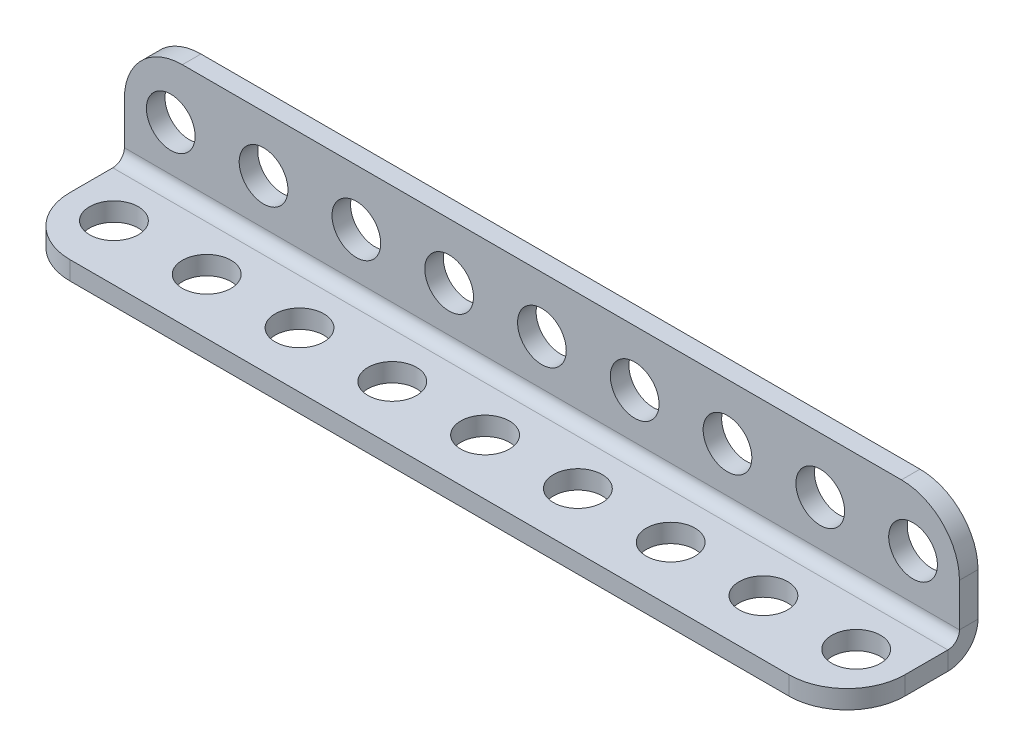
ISO-10303-21;
HEADER;
FILE_DESCRIPTION(('STEP AP214'),'2;1');
FILE_NAME('part.step','',(''),(''),'','','');
FILE_SCHEMA(('AUTOMOTIVE_DESIGN { 1 0 10303 214 1 1 1 1 }'));
ENDSEC;
DATA;
#1=APPLICATION_CONTEXT('core data for automotive mechanical design processes');
#2=APPLICATION_PROTOCOL_DEFINITION('international standard','automotive_design',2000,#1);
#3=PRODUCT_CONTEXT('',#1,'mechanical');
#4=PRODUCT('Part','Part','',(#3));
#5=PRODUCT_RELATED_PRODUCT_CATEGORY('part','',(#4));
#6=PRODUCT_DEFINITION_FORMATION('','',#4);
#7=PRODUCT_DEFINITION_CONTEXT('part definition',#1,'design');
#8=PRODUCT_DEFINITION('design','',#6,#7);
#9=PRODUCT_DEFINITION_SHAPE('','',#8);
#10=(LENGTH_UNIT() NAMED_UNIT(*) SI_UNIT(.MILLI.,.METRE.));
#11=(NAMED_UNIT(*) PLANE_ANGLE_UNIT() SI_UNIT($,.RADIAN.));
#12=(NAMED_UNIT(*) SI_UNIT($,.STERADIAN.) SOLID_ANGLE_UNIT());
#13=UNCERTAINTY_MEASURE_WITH_UNIT(LENGTH_MEASURE(1.E-05),#10,'distance_accuracy_value','');
#14=(GEOMETRIC_REPRESENTATION_CONTEXT(3) GLOBAL_UNCERTAINTY_ASSIGNED_CONTEXT((#13)) GLOBAL_UNIT_ASSIGNED_CONTEXT((#10,
#11,#12)) REPRESENTATION_CONTEXT('',''));
#15=CARTESIAN_POINT('',(0.,0.,0.));
#16=DIRECTION('',(0.,0.,1.));
#17=DIRECTION('',(1.,0.,0.));
#18=AXIS2_PLACEMENT_3D('',#15,#16,#17);
#19=CARTESIAN_POINT('',(72.,0.,2.6));
#20=DIRECTION('',(1.,0.,0.));
#21=DIRECTION('',(0.,0.,-1.));
#22=AXIS2_PLACEMENT_3D('',#19,#20,#21);
#23=PLANE('',#22);
#24=DIRECTION('',(0.,1.,0.));
#25=VECTOR('',#24,1.);
#26=CARTESIAN_POINT('',(72.,0.,2.6));
#27=LINE('',#26,#25);
#28=CARTESIAN_POINT('',(72.,0.,2.6));
#29=VERTEX_POINT('',#28);
#30=CARTESIAN_POINT('',(72.,1.6,2.6));
#31=VERTEX_POINT('',#30);
#32=EDGE_CURVE('E127',#29,#31,#27,.T.);
#33=ORIENTED_EDGE('',*,*,#32,.F.);
#34=CARTESIAN_POINT('',(72.,2.6,2.6));
#35=DIRECTION('',(1.,0.,0.));
#36=DIRECTION('',(0.,0.,-1.));
#37=AXIS2_PLACEMENT_3D('',#34,#35,#36);
#38=CIRCLE('',#37,2.6);
#39=CARTESIAN_POINT('',(72.,2.6,0.));
#40=VERTEX_POINT('',#39);
#41=EDGE_CURVE('E131',#40,#29,#38,.F.);
#42=ORIENTED_EDGE('',*,*,#41,.F.);
#43=DIRECTION('',(0.,0.,-1.));
#44=VECTOR('',#43,1.);
#45=CARTESIAN_POINT('',(72.,2.6,1.6));
#46=LINE('',#45,#44);
#47=CARTESIAN_POINT('',(72.,2.6,1.6));
#48=VERTEX_POINT('',#47);
#49=EDGE_CURVE('E139',#48,#40,#46,.T.);
#50=ORIENTED_EDGE('',*,*,#49,.F.);
#51=CARTESIAN_POINT('',(72.,2.6,2.6));
#52=DIRECTION('',(1.,0.,0.));
#53=DIRECTION('',(0.,0.,-1.));
#54=AXIS2_PLACEMENT_3D('',#51,#52,#53);
#55=CIRCLE('',#54,1.);
#56=EDGE_CURVE('E133',#48,#31,#55,.F.);
#57=ORIENTED_EDGE('',*,*,#56,.T.);
#58=EDGE_LOOP('',(#33,#42,#50,#57));
#59=FACE_BOUND('',#58,.T.);
#60=ADVANCED_FACE('F36',(#59),#23,.T.);
#61=CARTESIAN_POINT('',(72.,2.6,1.6));
#62=DIRECTION('',(1.,0.,0.));
#63=DIRECTION('',(0.,0.,-1.));
#64=AXIS2_PLACEMENT_3D('',#61,#62,#63);
#65=PLANE('',#64);
#66=DIRECTION('',(0.,0.,1.));
#67=VECTOR('',#66,1.);
#68=CARTESIAN_POINT('',(72.,1.6,0.));
#69=LINE('',#68,#67);
#70=CARTESIAN_POINT('',(72.,1.6,6.3));
#71=VERTEX_POINT('',#70);
#72=EDGE_CURVE('E161',#31,#71,#69,.T.);
#73=ORIENTED_EDGE('',*,*,#72,.T.);
#74=DIRECTION('',(0.,1.,0.));
#75=VECTOR('',#74,1.);
#76=CARTESIAN_POINT('',(72.,2.6,6.3));
#77=LINE('',#76,#75);
#78=CARTESIAN_POINT('',(72.,0.,6.3));
#79=VERTEX_POINT('',#78);
#80=EDGE_CURVE('E160',#71,#79,#77,.F.);
#81=ORIENTED_EDGE('',*,*,#80,.T.);
#82=DIRECTION('',(0.,0.,1.));
#83=VECTOR('',#82,1.);
#84=CARTESIAN_POINT('',(72.,0.,0.));
#85=LINE('',#84,#83);
#86=EDGE_CURVE('E148',#29,#79,#85,.T.);
#87=ORIENTED_EDGE('',*,*,#86,.F.);
#88=ORIENTED_EDGE('',*,*,#32,.T.);
#89=EDGE_LOOP('',(#73,#81,#87,#88));
#90=FACE_BOUND('',#89,.T.);
#91=ADVANCED_FACE('F158',(#90),#65,.T.);
#92=CARTESIAN_POINT('',(0.,2.6,0.));
#93=DIRECTION('',(-1.,0.,0.));
#94=DIRECTION('',(0.,0.,1.));
#95=AXIS2_PLACEMENT_3D('',#92,#93,#94);
#96=PLANE('',#95);
#97=DIRECTION('',(0.,0.,1.));
#98=VECTOR('',#97,1.);
#99=CARTESIAN_POINT('',(0.,2.6,0.));
#100=LINE('',#99,#98);
#101=CARTESIAN_POINT('',(0.,2.6,0.));
#102=VERTEX_POINT('',#101);
#103=CARTESIAN_POINT('',(0.,2.6,1.6));
#104=VERTEX_POINT('',#103);
#105=EDGE_CURVE('E206',#102,#104,#100,.T.);
#106=ORIENTED_EDGE('',*,*,#105,.F.);
#107=CARTESIAN_POINT('',(0.,2.6,2.6));
#108=DIRECTION('',(1.,0.,0.));
#109=DIRECTION('',(0.,0.,-1.));
#110=AXIS2_PLACEMENT_3D('',#107,#108,#109);
#111=CIRCLE('',#110,2.6);
#112=CARTESIAN_POINT('',(0.,0.,2.6));
#113=VERTEX_POINT('',#112);
#114=EDGE_CURVE('E180',#102,#113,#111,.F.);
#115=ORIENTED_EDGE('',*,*,#114,.T.);
#116=DIRECTION('',(0.,-1.,0.));
#117=VECTOR('',#116,1.);
#118=CARTESIAN_POINT('',(0.,1.6,2.6));
#119=LINE('',#118,#117);
#120=CARTESIAN_POINT('',(0.,1.6,2.6));
#121=VERTEX_POINT('',#120);
#122=EDGE_CURVE('E204',#121,#113,#119,.T.);
#123=ORIENTED_EDGE('',*,*,#122,.F.);
#124=CARTESIAN_POINT('',(0.,2.6,2.6));
#125=DIRECTION('',(1.,0.,0.));
#126=DIRECTION('',(0.,0.,-1.));
#127=AXIS2_PLACEMENT_3D('',#124,#125,#126);
#128=CIRCLE('',#127,1.);
#129=EDGE_CURVE('E186',#104,#121,#128,.F.);
#130=ORIENTED_EDGE('',*,*,#129,.F.);
#131=EDGE_LOOP('',(#106,#115,#123,#130));
#132=FACE_BOUND('',#131,.T.);
#133=ADVANCED_FACE('F419',(#132),#96,.T.);
#134=CARTESIAN_POINT('',(0.,1.6,2.6));
#135=DIRECTION('',(-1.,0.,0.));
#136=DIRECTION('',(0.,0.,1.));
#137=AXIS2_PLACEMENT_3D('',#134,#135,#136);
#138=PLANE('',#137);
#139=DIRECTION('',(0.,-1.,0.));
#140=VECTOR('',#139,1.);
#141=CARTESIAN_POINT('',(0.,11.3,1.6));
#142=LINE('',#141,#140);
#143=CARTESIAN_POINT('',(0.,6.3,1.6));
#144=VERTEX_POINT('',#143);
#145=EDGE_CURVE('E184',#144,#104,#142,.T.);
#146=ORIENTED_EDGE('',*,*,#145,.F.);
#147=DIRECTION('',(0.,0.,-1.));
#148=VECTOR('',#147,1.);
#149=CARTESIAN_POINT('',(0.,6.3,2.6));
#150=LINE('',#149,#148);
#151=CARTESIAN_POINT('',(0.,6.3,0.));
#152=VERTEX_POINT('',#151);
#153=EDGE_CURVE('E11',#144,#152,#150,.T.);
#154=ORIENTED_EDGE('',*,*,#153,.T.);
#155=DIRECTION('',(0.,-1.,0.));
#156=VECTOR('',#155,1.);
#157=CARTESIAN_POINT('',(0.,11.3,0.));
#158=LINE('',#157,#156);
#159=EDGE_CURVE('E182',#152,#102,#158,.T.);
#160=ORIENTED_EDGE('',*,*,#159,.T.);
#161=ORIENTED_EDGE('',*,*,#105,.T.);
#162=EDGE_LOOP('',(#146,#154,#160,#161));
#163=FACE_BOUND('',#162,.T.);
#164=ADVANCED_FACE('F380',(#163),#138,.T.);
#165=CARTESIAN_POINT('',(72.,1.6,0.));
#166=DIRECTION('',(0.,-1.,0.));
#167=DIRECTION('',(0.,0.,-1.));
#168=AXIS2_PLACEMENT_3D('',#165,#166,#167);
#169=PLANE('',#168);
#170=CARTESIAN_POINT('',(68.,1.6,6.5));
#171=DIRECTION('',(0.,1.,0.));
#172=DIRECTION('',(0.,0.,1.));
#173=AXIS2_PLACEMENT_3D('',#170,#171,#172);
#174=CIRCLE('',#173,2.1);
#175=CARTESIAN_POINT('',(68.,1.6,8.6));
#176=VERTEX_POINT('',#175);
#177=EDGE_CURVE('E362',#176,#176,#174,.T.);
#178=ORIENTED_EDGE('',*,*,#177,.F.);
#179=EDGE_LOOP('',(#178));
#180=FACE_BOUND('',#179,.T.);
#181=CARTESIAN_POINT('',(60.,1.6,6.5));
#182=DIRECTION('',(0.,1.,0.));
#183=DIRECTION('',(0.,0.,1.));
#184=AXIS2_PLACEMENT_3D('',#181,#182,#183);
#185=CIRCLE('',#184,2.1);
#186=CARTESIAN_POINT('',(60.,1.6,8.6));
#187=VERTEX_POINT('',#186);
#188=EDGE_CURVE('E356',#187,#187,#185,.T.);
#189=ORIENTED_EDGE('',*,*,#188,.F.);
#190=EDGE_LOOP('',(#189));
#191=FACE_BOUND('',#190,.T.);
#192=CARTESIAN_POINT('',(52.,1.6,6.5));
#193=DIRECTION('',(0.,1.,0.));
#194=DIRECTION('',(0.,0.,1.));
#195=AXIS2_PLACEMENT_3D('',#192,#193,#194);
#196=CIRCLE('',#195,2.1);
#197=CARTESIAN_POINT('',(52.,1.6,8.6));
#198=VERTEX_POINT('',#197);
#199=EDGE_CURVE('E350',#198,#198,#196,.T.);
#200=ORIENTED_EDGE('',*,*,#199,.F.);
#201=EDGE_LOOP('',(#200));
#202=FACE_BOUND('',#201,.T.);
#203=CARTESIAN_POINT('',(44.,1.6,6.5));
#204=DIRECTION('',(0.,1.,0.));
#205=DIRECTION('',(0.,0.,1.));
#206=AXIS2_PLACEMENT_3D('',#203,#204,#205);
#207=CIRCLE('',#206,2.1);
#208=CARTESIAN_POINT('',(44.,1.6,8.6));
#209=VERTEX_POINT('',#208);
#210=EDGE_CURVE('E344',#209,#209,#207,.T.);
#211=ORIENTED_EDGE('',*,*,#210,.F.);
#212=EDGE_LOOP('',(#211));
#213=FACE_BOUND('',#212,.T.);
#214=CARTESIAN_POINT('',(36.,1.6,6.5));
#215=DIRECTION('',(0.,1.,0.));
#216=DIRECTION('',(0.,0.,1.));
#217=AXIS2_PLACEMENT_3D('',#214,#215,#216);
#218=CIRCLE('',#217,2.1);
#219=CARTESIAN_POINT('',(36.,1.6,8.6));
#220=VERTEX_POINT('',#219);
#221=EDGE_CURVE('E338',#220,#220,#218,.T.);
#222=ORIENTED_EDGE('',*,*,#221,.F.);
#223=EDGE_LOOP('',(#222));
#224=FACE_BOUND('',#223,.T.);
#225=CARTESIAN_POINT('',(28.,1.6,6.5));
#226=DIRECTION('',(0.,1.,0.));
#227=DIRECTION('',(0.,0.,1.));
#228=AXIS2_PLACEMENT_3D('',#225,#226,#227);
#229=CIRCLE('',#228,2.1);
#230=CARTESIAN_POINT('',(28.,1.6,8.6));
#231=VERTEX_POINT('',#230);
#232=EDGE_CURVE('E332',#231,#231,#229,.T.);
#233=ORIENTED_EDGE('',*,*,#232,.F.);
#234=EDGE_LOOP('',(#233));
#235=FACE_BOUND('',#234,.T.);
#236=CARTESIAN_POINT('',(20.,1.6,6.5));
#237=DIRECTION('',(0.,1.,0.));
#238=DIRECTION('',(0.,0.,1.));
#239=AXIS2_PLACEMENT_3D('',#236,#237,#238);
#240=CIRCLE('',#239,2.1);
#241=CARTESIAN_POINT('',(20.,1.6,8.6));
#242=VERTEX_POINT('',#241);
#243=EDGE_CURVE('E326',#242,#242,#240,.T.);
#244=ORIENTED_EDGE('',*,*,#243,.F.);
#245=EDGE_LOOP('',(#244));
#246=FACE_BOUND('',#245,.T.);
#247=CARTESIAN_POINT('',(12.,1.6,6.5));
#248=DIRECTION('',(0.,1.,0.));
#249=DIRECTION('',(0.,0.,1.));
#250=AXIS2_PLACEMENT_3D('',#247,#248,#249);
#251=CIRCLE('',#250,2.1);
#252=CARTESIAN_POINT('',(12.,1.6,8.6));
#253=VERTEX_POINT('',#252);
#254=EDGE_CURVE('E320',#253,#253,#251,.T.);
#255=ORIENTED_EDGE('',*,*,#254,.F.);
#256=EDGE_LOOP('',(#255));
#257=FACE_BOUND('',#256,.T.);
#258=CARTESIAN_POINT('',(4.,1.6,6.5));
#259=DIRECTION('',(0.,1.,0.));
#260=DIRECTION('',(0.,0.,1.));
#261=AXIS2_PLACEMENT_3D('',#258,#259,#260);
#262=CIRCLE('',#261,2.1);
#263=CARTESIAN_POINT('',(4.,1.6,8.6));
#264=VERTEX_POINT('',#263);
#265=EDGE_CURVE('E266',#264,#264,#262,.T.);
#266=ORIENTED_EDGE('',*,*,#265,.F.);
#267=EDGE_LOOP('',(#266));
#268=FACE_BOUND('',#267,.T.);
#269=DIRECTION('',(0.,0.,1.));
#270=VECTOR('',#269,1.);
#271=CARTESIAN_POINT('',(0.,1.6,0.));
#272=LINE('',#271,#270);
#273=CARTESIAN_POINT('',(0.,1.6,6.3));
#274=VERTEX_POINT('',#273);
#275=EDGE_CURVE('E175',#121,#274,#272,.T.);
#276=ORIENTED_EDGE('',*,*,#275,.T.);
#277=CARTESIAN_POINT('',(5.,1.6,6.3));
#278=DIRECTION('',(0.,-1.,0.));
#279=DIRECTION('',(0.,0.,-1.));
#280=AXIS2_PLACEMENT_3D('',#277,#278,#279);
#281=CIRCLE('',#280,5.);
#282=CARTESIAN_POINT('',(5.,1.6,11.3));
#283=VERTEX_POINT('',#282);
#284=EDGE_CURVE('E215',#274,#283,#281,.F.);
#285=ORIENTED_EDGE('',*,*,#284,.T.);
#286=DIRECTION('',(-1.,0.,0.));
#287=VECTOR('',#286,1.);
#288=CARTESIAN_POINT('',(72.,1.6,11.3));
#289=LINE('',#288,#287);
#290=CARTESIAN_POINT('',(67.,1.6,11.3));
#291=VERTEX_POINT('',#290);
#292=EDGE_CURVE('E201',#291,#283,#289,.T.);
#293=ORIENTED_EDGE('',*,*,#292,.F.);
#294=CARTESIAN_POINT('',(67.,1.6,6.3));
#295=DIRECTION('',(0.,-1.,0.));
#296=DIRECTION('',(0.,0.,-1.));
#297=AXIS2_PLACEMENT_3D('',#294,#295,#296);
#298=CIRCLE('',#297,5.);
#299=EDGE_CURVE('E213',#291,#71,#298,.F.);
#300=ORIENTED_EDGE('',*,*,#299,.T.);
#301=ORIENTED_EDGE('',*,*,#72,.F.);
#302=DIRECTION('',(-1.,0.,0.));
#303=VECTOR('',#302,1.);
#304=CARTESIAN_POINT('',(72.,1.6,2.6));
#305=LINE('',#304,#303);
#306=EDGE_CURVE('E174',#31,#121,#305,.T.);
#307=ORIENTED_EDGE('',*,*,#306,.T.);
#308=EDGE_LOOP('',(#276,#285,#293,#300,#301,#307));
#309=FACE_BOUND('',#308,.T.);
#310=ADVANCED_FACE('F257',(#180,#191,#202,#213,#224,#235,#246,#257,#268,#309),#169,.F.);
#311=CARTESIAN_POINT('',(72.,0.,11.3));
#312=DIRECTION('',(0.,0.,1.));
#313=DIRECTION('',(1.,0.,0.));
#314=AXIS2_PLACEMENT_3D('',#311,#312,#313);
#315=PLANE('',#314);
#316=ORIENTED_EDGE('',*,*,#292,.T.);
#317=DIRECTION('',(0.,1.,0.));
#318=VECTOR('',#317,1.);
#319=CARTESIAN_POINT('',(5.,0.,11.3));
#320=LINE('',#319,#318);
#321=CARTESIAN_POINT('',(5.,0.,11.3));
#322=VERTEX_POINT('',#321);
#323=EDGE_CURVE('E220',#283,#322,#320,.F.);
#324=ORIENTED_EDGE('',*,*,#323,.T.);
#325=DIRECTION('',(-1.,0.,0.));
#326=VECTOR('',#325,1.);
#327=CARTESIAN_POINT('',(72.,0.,11.3));
#328=LINE('',#327,#326);
#329=CARTESIAN_POINT('',(67.,0.,11.3));
#330=VERTEX_POINT('',#329);
#331=EDGE_CURVE('E155',#330,#322,#328,.T.);
#332=ORIENTED_EDGE('',*,*,#331,.F.);
#333=DIRECTION('',(0.,1.,0.));
#334=VECTOR('',#333,1.);
#335=CARTESIAN_POINT('',(67.,0.,11.3));
#336=LINE('',#335,#334);
#337=EDGE_CURVE('E217',#330,#291,#336,.T.);
#338=ORIENTED_EDGE('',*,*,#337,.T.);
#339=EDGE_LOOP('',(#316,#324,#332,#338));
#340=FACE_BOUND('',#339,.T.);
#341=ADVANCED_FACE('F379',(#340),#315,.T.);
#342=CARTESIAN_POINT('',(72.,0.,0.));
#343=DIRECTION('',(0.,-1.,0.));
#344=DIRECTION('',(0.,0.,-1.));
#345=AXIS2_PLACEMENT_3D('',#342,#343,#344);
#346=PLANE('',#345);
#347=CARTESIAN_POINT('',(68.,0.,6.5));
#348=DIRECTION('',(0.,1.,0.));
#349=DIRECTION('',(0.,0.,1.));
#350=AXIS2_PLACEMENT_3D('',#347,#348,#349);
#351=CIRCLE('',#350,2.1);
#352=CARTESIAN_POINT('',(68.,0.,8.6));
#353=VERTEX_POINT('',#352);
#354=EDGE_CURVE('E359',#353,#353,#351,.T.);
#355=ORIENTED_EDGE('',*,*,#354,.T.);
#356=EDGE_LOOP('',(#355));
#357=FACE_BOUND('',#356,.T.);
#358=CARTESIAN_POINT('',(60.,0.,6.5));
#359=DIRECTION('',(0.,1.,0.));
#360=DIRECTION('',(0.,0.,1.));
#361=AXIS2_PLACEMENT_3D('',#358,#359,#360);
#362=CIRCLE('',#361,2.1);
#363=CARTESIAN_POINT('',(60.,0.,8.6));
#364=VERTEX_POINT('',#363);
#365=EDGE_CURVE('E353',#364,#364,#362,.T.);
#366=ORIENTED_EDGE('',*,*,#365,.T.);
#367=EDGE_LOOP('',(#366));
#368=FACE_BOUND('',#367,.T.);
#369=CARTESIAN_POINT('',(52.,0.,6.5));
#370=DIRECTION('',(0.,1.,0.));
#371=DIRECTION('',(0.,0.,1.));
#372=AXIS2_PLACEMENT_3D('',#369,#370,#371);
#373=CIRCLE('',#372,2.1);
#374=CARTESIAN_POINT('',(52.,0.,8.6));
#375=VERTEX_POINT('',#374);
#376=EDGE_CURVE('E347',#375,#375,#373,.T.);
#377=ORIENTED_EDGE('',*,*,#376,.T.);
#378=EDGE_LOOP('',(#377));
#379=FACE_BOUND('',#378,.T.);
#380=CARTESIAN_POINT('',(44.,0.,6.5));
#381=DIRECTION('',(0.,1.,0.));
#382=DIRECTION('',(0.,0.,1.));
#383=AXIS2_PLACEMENT_3D('',#380,#381,#382);
#384=CIRCLE('',#383,2.1);
#385=CARTESIAN_POINT('',(44.,0.,8.6));
#386=VERTEX_POINT('',#385);
#387=EDGE_CURVE('E341',#386,#386,#384,.T.);
#388=ORIENTED_EDGE('',*,*,#387,.T.);
#389=EDGE_LOOP('',(#388));
#390=FACE_BOUND('',#389,.T.);
#391=CARTESIAN_POINT('',(36.,0.,6.5));
#392=DIRECTION('',(0.,1.,0.));
#393=DIRECTION('',(0.,0.,1.));
#394=AXIS2_PLACEMENT_3D('',#391,#392,#393);
#395=CIRCLE('',#394,2.1);
#396=CARTESIAN_POINT('',(36.,0.,8.6));
#397=VERTEX_POINT('',#396);
#398=EDGE_CURVE('E335',#397,#397,#395,.T.);
#399=ORIENTED_EDGE('',*,*,#398,.T.);
#400=EDGE_LOOP('',(#399));
#401=FACE_BOUND('',#400,.T.);
#402=CARTESIAN_POINT('',(28.,0.,6.5));
#403=DIRECTION('',(0.,1.,0.));
#404=DIRECTION('',(0.,0.,1.));
#405=AXIS2_PLACEMENT_3D('',#402,#403,#404);
#406=CIRCLE('',#405,2.1);
#407=CARTESIAN_POINT('',(28.,0.,8.6));
#408=VERTEX_POINT('',#407);
#409=EDGE_CURVE('E329',#408,#408,#406,.T.);
#410=ORIENTED_EDGE('',*,*,#409,.T.);
#411=EDGE_LOOP('',(#410));
#412=FACE_BOUND('',#411,.T.);
#413=CARTESIAN_POINT('',(20.,0.,6.5));
#414=DIRECTION('',(0.,1.,0.));
#415=DIRECTION('',(0.,0.,1.));
#416=AXIS2_PLACEMENT_3D('',#413,#414,#415);
#417=CIRCLE('',#416,2.1);
#418=CARTESIAN_POINT('',(20.,0.,8.6));
#419=VERTEX_POINT('',#418);
#420=EDGE_CURVE('E323',#419,#419,#417,.T.);
#421=ORIENTED_EDGE('',*,*,#420,.T.);
#422=EDGE_LOOP('',(#421));
#423=FACE_BOUND('',#422,.T.);
#424=CARTESIAN_POINT('',(12.,0.,6.5));
#425=DIRECTION('',(0.,1.,0.));
#426=DIRECTION('',(0.,0.,1.));
#427=AXIS2_PLACEMENT_3D('',#424,#425,#426);
#428=CIRCLE('',#427,2.1);
#429=CARTESIAN_POINT('',(12.,0.,8.6));
#430=VERTEX_POINT('',#429);
#431=EDGE_CURVE('E317',#430,#430,#428,.T.);
#432=ORIENTED_EDGE('',*,*,#431,.T.);
#433=EDGE_LOOP('',(#432));
#434=FACE_BOUND('',#433,.T.);
#435=CARTESIAN_POINT('',(4.,0.,6.5));
#436=DIRECTION('',(0.,1.,0.));
#437=DIRECTION('',(0.,0.,1.));
#438=AXIS2_PLACEMENT_3D('',#435,#436,#437);
#439=CIRCLE('',#438,2.1);
#440=CARTESIAN_POINT('',(4.,0.,8.6));
#441=VERTEX_POINT('',#440);
#442=EDGE_CURVE('E263',#441,#441,#439,.T.);
#443=ORIENTED_EDGE('',*,*,#442,.T.);
#444=EDGE_LOOP('',(#443));
#445=FACE_BOUND('',#444,.T.);
#446=ORIENTED_EDGE('',*,*,#331,.T.);
#447=CARTESIAN_POINT('',(5.,0.,6.3));
#448=DIRECTION('',(0.,-1.,0.));
#449=DIRECTION('',(0.,0.,-1.));
#450=AXIS2_PLACEMENT_3D('',#447,#448,#449);
#451=CIRCLE('',#450,5.);
#452=CARTESIAN_POINT('',(0.,0.,6.3));
#453=VERTEX_POINT('',#452);
#454=EDGE_CURVE('E224',#322,#453,#451,.T.);
#455=ORIENTED_EDGE('',*,*,#454,.T.);
#456=DIRECTION('',(0.,0.,1.));
#457=VECTOR('',#456,1.);
#458=CARTESIAN_POINT('',(0.,0.,0.));
#459=LINE('',#458,#457);
#460=EDGE_CURVE('E151',#113,#453,#459,.T.);
#461=ORIENTED_EDGE('',*,*,#460,.F.);
#462=DIRECTION('',(-1.,0.,0.));
#463=VECTOR('',#462,1.);
#464=CARTESIAN_POINT('',(72.,0.,2.6));
#465=LINE('',#464,#463);
#466=EDGE_CURVE('E145',#29,#113,#465,.T.);
#467=ORIENTED_EDGE('',*,*,#466,.F.);
#468=ORIENTED_EDGE('',*,*,#86,.T.);
#469=CARTESIAN_POINT('',(67.,0.,6.3));
#470=DIRECTION('',(0.,-1.,0.));
#471=DIRECTION('',(0.,0.,-1.));
#472=AXIS2_PLACEMENT_3D('',#469,#470,#471);
#473=CIRCLE('',#472,5.);
#474=EDGE_CURVE('E222',#79,#330,#473,.T.);
#475=ORIENTED_EDGE('',*,*,#474,.T.);
#476=EDGE_LOOP('',(#446,#455,#461,#467,#468,#475));
#477=FACE_BOUND('',#476,.T.);
#478=ADVANCED_FACE('F147',(#357,#368,#379,#390,#401,#412,#423,#434,#445,#477),#346,.T.);
#479=CARTESIAN_POINT('',(72.,2.6,2.6));
#480=DIRECTION('',(-1.,0.,0.));
#481=DIRECTION('',(0.,0.,1.));
#482=AXIS2_PLACEMENT_3D('',#479,#480,#481);
#483=CYLINDRICAL_SURFACE('',#482,2.6);
#484=ORIENTED_EDGE('',*,*,#114,.F.);
#485=DIRECTION('',(-1.,0.,0.));
#486=VECTOR('',#485,1.);
#487=CARTESIAN_POINT('',(72.,2.6,0.));
#488=LINE('',#487,#486);
#489=EDGE_CURVE('E156',#40,#102,#488,.T.);
#490=ORIENTED_EDGE('',*,*,#489,.F.);
#491=ORIENTED_EDGE('',*,*,#41,.T.);
#492=ORIENTED_EDGE('',*,*,#466,.T.);
#493=EDGE_LOOP('',(#484,#490,#491,#492));
#494=FACE_BOUND('',#493,.T.);
#495=ADVANCED_FACE('F164',(#494),#483,.T.);
#496=CARTESIAN_POINT('',(72.,11.3,0.));
#497=DIRECTION('',(0.,0.,-1.));
#498=DIRECTION('',(0.,1.,0.));
#499=AXIS2_PLACEMENT_3D('',#496,#497,#498);
#500=PLANE('',#499);
#501=CARTESIAN_POINT('',(68.,6.5,0.));
#502=DIRECTION('',(0.,0.,1.));
#503=DIRECTION('',(1.,0.,0.));
#504=AXIS2_PLACEMENT_3D('',#501,#502,#503);
#505=CIRCLE('',#504,2.1);
#506=CARTESIAN_POINT('',(70.1,6.5,0.));
#507=VERTEX_POINT('',#506);
#508=EDGE_CURVE('E311',#507,#507,#505,.T.);
#509=ORIENTED_EDGE('',*,*,#508,.T.);
#510=EDGE_LOOP('',(#509));
#511=FACE_BOUND('',#510,.T.);
#512=CARTESIAN_POINT('',(60.,6.5,0.));
#513=DIRECTION('',(0.,0.,1.));
#514=DIRECTION('',(1.,0.,0.));
#515=AXIS2_PLACEMENT_3D('',#512,#513,#514);
#516=CIRCLE('',#515,2.1);
#517=CARTESIAN_POINT('',(62.1,6.5,0.));
#518=VERTEX_POINT('',#517);
#519=EDGE_CURVE('E305',#518,#518,#516,.T.);
#520=ORIENTED_EDGE('',*,*,#519,.T.);
#521=EDGE_LOOP('',(#520));
#522=FACE_BOUND('',#521,.T.);
#523=CARTESIAN_POINT('',(52.,6.5,0.));
#524=DIRECTION('',(0.,0.,1.));
#525=DIRECTION('',(1.,0.,0.));
#526=AXIS2_PLACEMENT_3D('',#523,#524,#525);
#527=CIRCLE('',#526,2.1);
#528=CARTESIAN_POINT('',(54.1,6.5,0.));
#529=VERTEX_POINT('',#528);
#530=EDGE_CURVE('E299',#529,#529,#527,.T.);
#531=ORIENTED_EDGE('',*,*,#530,.T.);
#532=EDGE_LOOP('',(#531));
#533=FACE_BOUND('',#532,.T.);
#534=CARTESIAN_POINT('',(44.,6.5,0.));
#535=DIRECTION('',(0.,0.,1.));
#536=DIRECTION('',(1.,0.,0.));
#537=AXIS2_PLACEMENT_3D('',#534,#535,#536);
#538=CIRCLE('',#537,2.1);
#539=CARTESIAN_POINT('',(46.1,6.5,0.));
#540=VERTEX_POINT('',#539);
#541=EDGE_CURVE('E293',#540,#540,#538,.T.);
#542=ORIENTED_EDGE('',*,*,#541,.T.);
#543=EDGE_LOOP('',(#542));
#544=FACE_BOUND('',#543,.T.);
#545=CARTESIAN_POINT('',(36.,6.5,0.));
#546=DIRECTION('',(0.,0.,1.));
#547=DIRECTION('',(1.,0.,0.));
#548=AXIS2_PLACEMENT_3D('',#545,#546,#547);
#549=CIRCLE('',#548,2.1);
#550=CARTESIAN_POINT('',(38.1,6.5,0.));
#551=VERTEX_POINT('',#550);
#552=EDGE_CURVE('E287',#551,#551,#549,.T.);
#553=ORIENTED_EDGE('',*,*,#552,.T.);
#554=EDGE_LOOP('',(#553));
#555=FACE_BOUND('',#554,.T.);
#556=CARTESIAN_POINT('',(28.,6.5,0.));
#557=DIRECTION('',(0.,0.,1.));
#558=DIRECTION('',(1.,0.,0.));
#559=AXIS2_PLACEMENT_3D('',#556,#557,#558);
#560=CIRCLE('',#559,2.1);
#561=CARTESIAN_POINT('',(30.1,6.5,0.));
#562=VERTEX_POINT('',#561);
#563=EDGE_CURVE('E281',#562,#562,#560,.T.);
#564=ORIENTED_EDGE('',*,*,#563,.T.);
#565=EDGE_LOOP('',(#564));
#566=FACE_BOUND('',#565,.T.);
#567=CARTESIAN_POINT('',(20.,6.5,0.));
#568=DIRECTION('',(0.,0.,1.));
#569=DIRECTION('',(1.,0.,0.));
#570=AXIS2_PLACEMENT_3D('',#567,#568,#569);
#571=CIRCLE('',#570,2.1);
#572=CARTESIAN_POINT('',(22.1,6.5,0.));
#573=VERTEX_POINT('',#572);
#574=EDGE_CURVE('E275',#573,#573,#571,.T.);
#575=ORIENTED_EDGE('',*,*,#574,.T.);
#576=EDGE_LOOP('',(#575));
#577=FACE_BOUND('',#576,.T.);
#578=CARTESIAN_POINT('',(12.,6.5,0.));
#579=DIRECTION('',(0.,0.,1.));
#580=DIRECTION('',(1.,0.,0.));
#581=AXIS2_PLACEMENT_3D('',#578,#579,#580);
#582=CIRCLE('',#581,2.1);
#583=CARTESIAN_POINT('',(14.1,6.5,0.));
#584=VERTEX_POINT('',#583);
#585=EDGE_CURVE('E269',#584,#584,#582,.T.);
#586=ORIENTED_EDGE('',*,*,#585,.T.);
#587=EDGE_LOOP('',(#586));
#588=FACE_BOUND('',#587,.T.);
#589=CARTESIAN_POINT('',(4.,6.5,0.));
#590=DIRECTION('',(0.,0.,1.));
#591=DIRECTION('',(1.,0.,0.));
#592=AXIS2_PLACEMENT_3D('',#589,#590,#591);
#593=CIRCLE('',#592,2.1);
#594=CARTESIAN_POINT('',(6.1,6.5,0.));
#595=VERTEX_POINT('',#594);
#596=EDGE_CURVE('E178',#595,#595,#593,.T.);
#597=ORIENTED_EDGE('',*,*,#596,.T.);
#598=EDGE_LOOP('',(#597));
#599=FACE_BOUND('',#598,.T.);
#600=DIRECTION('',(-1.,0.,0.));
#601=VECTOR('',#600,1.);
#602=CARTESIAN_POINT('',(72.,11.3,0.));
#603=LINE('',#602,#601);
#604=CARTESIAN_POINT('',(67.,11.3,0.));
#605=VERTEX_POINT('',#604);
#606=CARTESIAN_POINT('',(5.,11.3,0.));
#607=VERTEX_POINT('',#606);
#608=EDGE_CURVE('E196',#605,#607,#603,.T.);
#609=ORIENTED_EDGE('',*,*,#608,.F.);
#610=CARTESIAN_POINT('',(67.,6.3,0.));
#611=DIRECTION('',(0.,0.,-1.));
#612=DIRECTION('',(0.,1.,0.));
#613=AXIS2_PLACEMENT_3D('',#610,#611,#612);
#614=CIRCLE('',#613,5.);
#615=CARTESIAN_POINT('',(72.,6.3,0.));
#616=VERTEX_POINT('',#615);
#617=EDGE_CURVE('E234',#605,#616,#614,.T.);
#618=ORIENTED_EDGE('',*,*,#617,.T.);
#619=DIRECTION('',(0.,-1.,0.));
#620=VECTOR('',#619,1.);
#621=CARTESIAN_POINT('',(72.,11.3,0.));
#622=LINE('',#621,#620);
#623=EDGE_CURVE('E166',#616,#40,#622,.T.);
#624=ORIENTED_EDGE('',*,*,#623,.T.);
#625=ORIENTED_EDGE('',*,*,#489,.T.);
#626=ORIENTED_EDGE('',*,*,#159,.F.);
#627=CARTESIAN_POINT('',(5.,6.3,0.));
#628=DIRECTION('',(0.,0.,-1.));
#629=DIRECTION('',(0.,1.,0.));
#630=AXIS2_PLACEMENT_3D('',#627,#628,#629);
#631=CIRCLE('',#630,5.);
#632=EDGE_CURVE('E232',#152,#607,#631,.T.);
#633=ORIENTED_EDGE('',*,*,#632,.T.);
#634=EDGE_LOOP('',(#609,#618,#624,#625,#626,#633));
#635=FACE_BOUND('',#634,.T.);
#636=ADVANCED_FACE('F249',(#511,#522,#533,#544,#555,#566,#577,#588,#599,#635),#500,.T.);
#637=CARTESIAN_POINT('',(72.,11.3,1.6));
#638=DIRECTION('',(0.,1.,0.));
#639=DIRECTION('',(0.,0.,1.));
#640=AXIS2_PLACEMENT_3D('',#637,#638,#639);
#641=PLANE('',#640);
#642=DIRECTION('',(-1.,0.,0.));
#643=VECTOR('',#642,1.);
#644=CARTESIAN_POINT('',(72.,11.3,1.6));
#645=LINE('',#644,#643);
#646=CARTESIAN_POINT('',(67.,11.3,1.6));
#647=VERTEX_POINT('',#646);
#648=CARTESIAN_POINT('',(5.,11.3,1.6));
#649=VERTEX_POINT('',#648);
#650=EDGE_CURVE('E194',#647,#649,#645,.T.);
#651=ORIENTED_EDGE('',*,*,#650,.F.);
#652=DIRECTION('',(0.,0.,-1.));
#653=VECTOR('',#652,1.);
#654=CARTESIAN_POINT('',(67.,11.3,1.6));
#655=LINE('',#654,#653);
#656=EDGE_CURVE('E229',#647,#605,#655,.T.);
#657=ORIENTED_EDGE('',*,*,#656,.T.);
#658=ORIENTED_EDGE('',*,*,#608,.T.);
#659=DIRECTION('',(0.,0.,-1.));
#660=VECTOR('',#659,1.);
#661=CARTESIAN_POINT('',(5.,11.3,1.6));
#662=LINE('',#661,#660);
#663=EDGE_CURVE('E227',#607,#649,#662,.F.);
#664=ORIENTED_EDGE('',*,*,#663,.T.);
#665=EDGE_LOOP('',(#651,#657,#658,#664));
#666=FACE_BOUND('',#665,.T.);
#667=ADVANCED_FACE('F244',(#666),#641,.T.);
#668=CARTESIAN_POINT('',(72.,11.3,1.6));
#669=DIRECTION('',(0.,0.,-1.));
#670=DIRECTION('',(0.,1.,0.));
#671=AXIS2_PLACEMENT_3D('',#668,#669,#670);
#672=PLANE('',#671);
#673=CARTESIAN_POINT('',(68.,6.5,1.6));
#674=DIRECTION('',(0.,0.,1.));
#675=DIRECTION('',(1.,0.,0.));
#676=AXIS2_PLACEMENT_3D('',#673,#674,#675);
#677=CIRCLE('',#676,2.1);
#678=CARTESIAN_POINT('',(70.1,6.5,1.6));
#679=VERTEX_POINT('',#678);
#680=EDGE_CURVE('E314',#679,#679,#677,.T.);
#681=ORIENTED_EDGE('',*,*,#680,.F.);
#682=EDGE_LOOP('',(#681));
#683=FACE_BOUND('',#682,.T.);
#684=CARTESIAN_POINT('',(60.,6.5,1.6));
#685=DIRECTION('',(0.,0.,1.));
#686=DIRECTION('',(1.,0.,0.));
#687=AXIS2_PLACEMENT_3D('',#684,#685,#686);
#688=CIRCLE('',#687,2.1);
#689=CARTESIAN_POINT('',(62.1,6.5,1.6));
#690=VERTEX_POINT('',#689);
#691=EDGE_CURVE('E308',#690,#690,#688,.T.);
#692=ORIENTED_EDGE('',*,*,#691,.F.);
#693=EDGE_LOOP('',(#692));
#694=FACE_BOUND('',#693,.T.);
#695=CARTESIAN_POINT('',(52.,6.5,1.6));
#696=DIRECTION('',(0.,0.,1.));
#697=DIRECTION('',(1.,0.,0.));
#698=AXIS2_PLACEMENT_3D('',#695,#696,#697);
#699=CIRCLE('',#698,2.1);
#700=CARTESIAN_POINT('',(54.1,6.5,1.6));
#701=VERTEX_POINT('',#700);
#702=EDGE_CURVE('E302',#701,#701,#699,.T.);
#703=ORIENTED_EDGE('',*,*,#702,.F.);
#704=EDGE_LOOP('',(#703));
#705=FACE_BOUND('',#704,.T.);
#706=CARTESIAN_POINT('',(44.,6.5,1.6));
#707=DIRECTION('',(0.,0.,1.));
#708=DIRECTION('',(1.,0.,0.));
#709=AXIS2_PLACEMENT_3D('',#706,#707,#708);
#710=CIRCLE('',#709,2.1);
#711=CARTESIAN_POINT('',(46.1,6.5,1.6));
#712=VERTEX_POINT('',#711);
#713=EDGE_CURVE('E296',#712,#712,#710,.T.);
#714=ORIENTED_EDGE('',*,*,#713,.F.);
#715=EDGE_LOOP('',(#714));
#716=FACE_BOUND('',#715,.T.);
#717=CARTESIAN_POINT('',(36.,6.5,1.6));
#718=DIRECTION('',(0.,0.,1.));
#719=DIRECTION('',(1.,0.,0.));
#720=AXIS2_PLACEMENT_3D('',#717,#718,#719);
#721=CIRCLE('',#720,2.1);
#722=CARTESIAN_POINT('',(38.1,6.5,1.6));
#723=VERTEX_POINT('',#722);
#724=EDGE_CURVE('E290',#723,#723,#721,.T.);
#725=ORIENTED_EDGE('',*,*,#724,.F.);
#726=EDGE_LOOP('',(#725));
#727=FACE_BOUND('',#726,.T.);
#728=CARTESIAN_POINT('',(28.,6.5,1.6));
#729=DIRECTION('',(0.,0.,1.));
#730=DIRECTION('',(1.,0.,0.));
#731=AXIS2_PLACEMENT_3D('',#728,#729,#730);
#732=CIRCLE('',#731,2.1);
#733=CARTESIAN_POINT('',(30.1,6.5,1.6));
#734=VERTEX_POINT('',#733);
#735=EDGE_CURVE('E284',#734,#734,#732,.T.);
#736=ORIENTED_EDGE('',*,*,#735,.F.);
#737=EDGE_LOOP('',(#736));
#738=FACE_BOUND('',#737,.T.);
#739=CARTESIAN_POINT('',(20.,6.5,1.6));
#740=DIRECTION('',(0.,0.,1.));
#741=DIRECTION('',(1.,0.,0.));
#742=AXIS2_PLACEMENT_3D('',#739,#740,#741);
#743=CIRCLE('',#742,2.1);
#744=CARTESIAN_POINT('',(22.1,6.5,1.6));
#745=VERTEX_POINT('',#744);
#746=EDGE_CURVE('E278',#745,#745,#743,.T.);
#747=ORIENTED_EDGE('',*,*,#746,.F.);
#748=EDGE_LOOP('',(#747));
#749=FACE_BOUND('',#748,.T.);
#750=CARTESIAN_POINT('',(12.,6.5,1.6));
#751=DIRECTION('',(0.,0.,1.));
#752=DIRECTION('',(1.,0.,0.));
#753=AXIS2_PLACEMENT_3D('',#750,#751,#752);
#754=CIRCLE('',#753,2.1);
#755=CARTESIAN_POINT('',(14.1,6.5,1.6));
#756=VERTEX_POINT('',#755);
#757=EDGE_CURVE('E272',#756,#756,#754,.T.);
#758=ORIENTED_EDGE('',*,*,#757,.F.);
#759=EDGE_LOOP('',(#758));
#760=FACE_BOUND('',#759,.T.);
#761=CARTESIAN_POINT('',(4.,6.5,1.6));
#762=DIRECTION('',(0.,0.,1.));
#763=DIRECTION('',(1.,0.,0.));
#764=AXIS2_PLACEMENT_3D('',#761,#762,#763);
#765=CIRCLE('',#764,2.1);
#766=CARTESIAN_POINT('',(6.1,6.5,1.6));
#767=VERTEX_POINT('',#766);
#768=EDGE_CURVE('E260',#767,#767,#765,.T.);
#769=ORIENTED_EDGE('',*,*,#768,.F.);
#770=EDGE_LOOP('',(#769));
#771=FACE_BOUND('',#770,.T.);
#772=DIRECTION('',(0.,-1.,0.));
#773=VECTOR('',#772,1.);
#774=CARTESIAN_POINT('',(72.,11.3,1.6));
#775=LINE('',#774,#773);
#776=CARTESIAN_POINT('',(72.,6.3,1.6));
#777=VERTEX_POINT('',#776);
#778=EDGE_CURVE('E168',#777,#48,#775,.T.);
#779=ORIENTED_EDGE('',*,*,#778,.F.);
#780=CARTESIAN_POINT('',(67.,6.3,1.6));
#781=DIRECTION('',(0.,0.,-1.));
#782=DIRECTION('',(0.,1.,0.));
#783=AXIS2_PLACEMENT_3D('',#780,#781,#782);
#784=CIRCLE('',#783,5.);
#785=EDGE_CURVE('E44',#777,#647,#784,.F.);
#786=ORIENTED_EDGE('',*,*,#785,.T.);
#787=ORIENTED_EDGE('',*,*,#650,.T.);
#788=CARTESIAN_POINT('',(5.,6.3,1.6));
#789=DIRECTION('',(0.,0.,-1.));
#790=DIRECTION('',(0.,1.,0.));
#791=AXIS2_PLACEMENT_3D('',#788,#789,#790);
#792=CIRCLE('',#791,5.);
#793=EDGE_CURVE('E51',#649,#144,#792,.F.);
#794=ORIENTED_EDGE('',*,*,#793,.T.);
#795=ORIENTED_EDGE('',*,*,#145,.T.);
#796=DIRECTION('',(-1.,0.,0.));
#797=VECTOR('',#796,1.);
#798=CARTESIAN_POINT('',(72.,2.6,1.6));
#799=LINE('',#798,#797);
#800=EDGE_CURVE('E191',#48,#104,#799,.T.);
#801=ORIENTED_EDGE('',*,*,#800,.F.);
#802=EDGE_LOOP('',(#779,#786,#787,#794,#795,#801));
#803=FACE_BOUND('',#802,.T.);
#804=ADVANCED_FACE('F239',(#683,#694,#705,#716,#727,#738,#749,#760,#771,#803),#672,.F.);
#805=CARTESIAN_POINT('',(72.,2.6,2.6));
#806=DIRECTION('',(-1.,0.,0.));
#807=DIRECTION('',(0.,0.,1.));
#808=AXIS2_PLACEMENT_3D('',#805,#806,#807);
#809=CYLINDRICAL_SURFACE('',#808,1.);
#810=ORIENTED_EDGE('',*,*,#129,.T.);
#811=ORIENTED_EDGE('',*,*,#306,.F.);
#812=ORIENTED_EDGE('',*,*,#56,.F.);
#813=ORIENTED_EDGE('',*,*,#800,.T.);
#814=EDGE_LOOP('',(#810,#811,#812,#813));
#815=FACE_BOUND('',#814,.T.);
#816=ADVANCED_FACE('F253',(#815),#809,.F.);
#817=CARTESIAN_POINT('',(72.,2.6,2.6));
#818=DIRECTION('',(1.,0.,0.));
#819=DIRECTION('',(0.,0.,-1.));
#820=AXIS2_PLACEMENT_3D('',#817,#818,#819);
#821=PLANE('',#820);
#822=ORIENTED_EDGE('',*,*,#623,.F.);
#823=DIRECTION('',(0.,0.,-1.));
#824=VECTOR('',#823,1.);
#825=CARTESIAN_POINT('',(72.,6.3,2.6));
#826=LINE('',#825,#824);
#827=EDGE_CURVE('E59',#616,#777,#826,.F.);
#828=ORIENTED_EDGE('',*,*,#827,.T.);
#829=ORIENTED_EDGE('',*,*,#778,.T.);
#830=ORIENTED_EDGE('',*,*,#49,.T.);
#831=EDGE_LOOP('',(#822,#828,#829,#830));
#832=FACE_BOUND('',#831,.T.);
#833=ADVANCED_FACE('F250',(#832),#821,.T.);
#834=CARTESIAN_POINT('',(0.,2.6,2.6));
#835=DIRECTION('',(1.,0.,0.));
#836=DIRECTION('',(0.,0.,-1.));
#837=AXIS2_PLACEMENT_3D('',#834,#835,#836);
#838=PLANE('',#837);
#839=ORIENTED_EDGE('',*,*,#460,.T.);
#840=DIRECTION('',(0.,1.,0.));
#841=VECTOR('',#840,1.);
#842=CARTESIAN_POINT('',(0.,1.6,6.3));
#843=LINE('',#842,#841);
#844=EDGE_CURVE('E138',#453,#274,#843,.T.);
#845=ORIENTED_EDGE('',*,*,#844,.T.);
#846=ORIENTED_EDGE('',*,*,#275,.F.);
#847=ORIENTED_EDGE('',*,*,#122,.T.);
#848=EDGE_LOOP('',(#839,#845,#846,#847));
#849=FACE_BOUND('',#848,.T.);
#850=ADVANCED_FACE('F427',(#849),#838,.F.);
#851=CARTESIAN_POINT('',(5.,2.6,6.3));
#852=DIRECTION('',(0.,-1.,0.));
#853=DIRECTION('',(0.,0.,-1.));
#854=AXIS2_PLACEMENT_3D('',#851,#852,#853);
#855=CYLINDRICAL_SURFACE('',#854,5.);
#856=ORIENTED_EDGE('',*,*,#454,.F.);
#857=ORIENTED_EDGE('',*,*,#323,.F.);
#858=ORIENTED_EDGE('',*,*,#284,.F.);
#859=ORIENTED_EDGE('',*,*,#844,.F.);
#860=EDGE_LOOP('',(#856,#857,#858,#859));
#861=FACE_BOUND('',#860,.T.);
#862=ADVANCED_FACE('F423',(#861),#855,.T.);
#863=CARTESIAN_POINT('',(67.,0.,6.3));
#864=DIRECTION('',(0.,1.,0.));
#865=DIRECTION('',(0.,0.,1.));
#866=AXIS2_PLACEMENT_3D('',#863,#864,#865);
#867=CYLINDRICAL_SURFACE('',#866,5.);
#868=ORIENTED_EDGE('',*,*,#474,.F.);
#869=ORIENTED_EDGE('',*,*,#80,.F.);
#870=ORIENTED_EDGE('',*,*,#299,.F.);
#871=ORIENTED_EDGE('',*,*,#337,.F.);
#872=EDGE_LOOP('',(#868,#869,#870,#871));
#873=FACE_BOUND('',#872,.T.);
#874=ADVANCED_FACE('F426',(#873),#867,.T.);
#875=CARTESIAN_POINT('',(67.,6.3,1.6));
#876=DIRECTION('',(0.,0.,-1.));
#877=DIRECTION('',(-1.,0.,0.));
#878=AXIS2_PLACEMENT_3D('',#875,#876,#877);
#879=CYLINDRICAL_SURFACE('',#878,5.);
#880=ORIENTED_EDGE('',*,*,#785,.F.);
#881=ORIENTED_EDGE('',*,*,#827,.F.);
#882=ORIENTED_EDGE('',*,*,#617,.F.);
#883=ORIENTED_EDGE('',*,*,#656,.F.);
#884=EDGE_LOOP('',(#880,#881,#882,#883));
#885=FACE_BOUND('',#884,.T.);
#886=ADVANCED_FACE('F247',(#885),#879,.T.);
#887=CARTESIAN_POINT('',(5.,6.3,2.6));
#888=DIRECTION('',(0.,0.,-1.));
#889=DIRECTION('',(-1.,0.,0.));
#890=AXIS2_PLACEMENT_3D('',#887,#888,#889);
#891=CYLINDRICAL_SURFACE('',#890,5.);
#892=ORIENTED_EDGE('',*,*,#793,.F.);
#893=ORIENTED_EDGE('',*,*,#663,.F.);
#894=ORIENTED_EDGE('',*,*,#632,.F.);
#895=ORIENTED_EDGE('',*,*,#153,.F.);
#896=EDGE_LOOP('',(#892,#893,#894,#895));
#897=FACE_BOUND('',#896,.T.);
#898=ADVANCED_FACE('F38',(#897),#891,.T.);
#899=CARTESIAN_POINT('',(4.,6.5,0.));
#900=DIRECTION('',(0.,0.,1.));
#901=DIRECTION('',(1.,0.,0.));
#902=AXIS2_PLACEMENT_3D('',#899,#900,#901);
#903=CYLINDRICAL_SURFACE('',#902,2.1);
#904=ORIENTED_EDGE('',*,*,#596,.F.);
#905=EDGE_LOOP('',(#904));
#906=FACE_BOUND('',#905,.T.);
#907=ORIENTED_EDGE('',*,*,#768,.T.);
#908=EDGE_LOOP('',(#907));
#909=FACE_BOUND('',#908,.T.);
#910=ADVANCED_FACE('F401',(#906,#909),#903,.F.);
#911=CARTESIAN_POINT('',(4.,0.,6.5));
#912=DIRECTION('',(0.,1.,0.));
#913=DIRECTION('',(0.,0.,1.));
#914=AXIS2_PLACEMENT_3D('',#911,#912,#913);
#915=CYLINDRICAL_SURFACE('',#914,2.1);
#916=ORIENTED_EDGE('',*,*,#442,.F.);
#917=EDGE_LOOP('',(#916));
#918=FACE_BOUND('',#917,.T.);
#919=ORIENTED_EDGE('',*,*,#265,.T.);
#920=EDGE_LOOP('',(#919));
#921=FACE_BOUND('',#920,.T.);
#922=ADVANCED_FACE('F398',(#918,#921),#915,.F.);
#923=CARTESIAN_POINT('',(12.,6.5,0.));
#924=DIRECTION('',(0.,0.,1.));
#925=DIRECTION('',(1.,0.,0.));
#926=AXIS2_PLACEMENT_3D('',#923,#924,#925);
#927=CYLINDRICAL_SURFACE('',#926,2.1);
#928=ORIENTED_EDGE('',*,*,#585,.F.);
#929=EDGE_LOOP('',(#928));
#930=FACE_BOUND('',#929,.T.);
#931=ORIENTED_EDGE('',*,*,#757,.T.);
#932=EDGE_LOOP('',(#931));
#933=FACE_BOUND('',#932,.T.);
#934=ADVANCED_FACE('F400',(#930,#933),#927,.F.);
#935=CARTESIAN_POINT('',(20.,6.5,0.));
#936=DIRECTION('',(0.,0.,1.));
#937=DIRECTION('',(1.,0.,0.));
#938=AXIS2_PLACEMENT_3D('',#935,#936,#937);
#939=CYLINDRICAL_SURFACE('',#938,2.1);
#940=ORIENTED_EDGE('',*,*,#574,.F.);
#941=EDGE_LOOP('',(#940));
#942=FACE_BOUND('',#941,.T.);
#943=ORIENTED_EDGE('',*,*,#746,.T.);
#944=EDGE_LOOP('',(#943));
#945=FACE_BOUND('',#944,.T.);
#946=ADVANCED_FACE('F408',(#942,#945),#939,.F.);
#947=CARTESIAN_POINT('',(28.,6.5,0.));
#948=DIRECTION('',(0.,0.,1.));
#949=DIRECTION('',(1.,0.,0.));
#950=AXIS2_PLACEMENT_3D('',#947,#948,#949);
#951=CYLINDRICAL_SURFACE('',#950,2.1);
#952=ORIENTED_EDGE('',*,*,#563,.F.);
#953=EDGE_LOOP('',(#952));
#954=FACE_BOUND('',#953,.T.);
#955=ORIENTED_EDGE('',*,*,#735,.T.);
#956=EDGE_LOOP('',(#955));
#957=FACE_BOUND('',#956,.T.);
#958=ADVANCED_FACE('F527',(#954,#957),#951,.F.);
#959=CARTESIAN_POINT('',(36.,6.5,0.));
#960=DIRECTION('',(0.,0.,1.));
#961=DIRECTION('',(1.,0.,0.));
#962=AXIS2_PLACEMENT_3D('',#959,#960,#961);
#963=CYLINDRICAL_SURFACE('',#962,2.1);
#964=ORIENTED_EDGE('',*,*,#552,.F.);
#965=EDGE_LOOP('',(#964));
#966=FACE_BOUND('',#965,.T.);
#967=ORIENTED_EDGE('',*,*,#724,.T.);
#968=EDGE_LOOP('',(#967));
#969=FACE_BOUND('',#968,.T.);
#970=ADVANCED_FACE('F538',(#966,#969),#963,.F.);
#971=CARTESIAN_POINT('',(44.,6.5,0.));
#972=DIRECTION('',(0.,0.,1.));
#973=DIRECTION('',(1.,0.,0.));
#974=AXIS2_PLACEMENT_3D('',#971,#972,#973);
#975=CYLINDRICAL_SURFACE('',#974,2.1);
#976=ORIENTED_EDGE('',*,*,#541,.F.);
#977=EDGE_LOOP('',(#976));
#978=FACE_BOUND('',#977,.T.);
#979=ORIENTED_EDGE('',*,*,#713,.T.);
#980=EDGE_LOOP('',(#979));
#981=FACE_BOUND('',#980,.T.);
#982=ADVANCED_FACE('F549',(#978,#981),#975,.F.);
#983=CARTESIAN_POINT('',(52.,6.5,0.));
#984=DIRECTION('',(0.,0.,1.));
#985=DIRECTION('',(1.,0.,0.));
#986=AXIS2_PLACEMENT_3D('',#983,#984,#985);
#987=CYLINDRICAL_SURFACE('',#986,2.1);
#988=ORIENTED_EDGE('',*,*,#530,.F.);
#989=EDGE_LOOP('',(#988));
#990=FACE_BOUND('',#989,.T.);
#991=ORIENTED_EDGE('',*,*,#702,.T.);
#992=EDGE_LOOP('',(#991));
#993=FACE_BOUND('',#992,.T.);
#994=ADVANCED_FACE('F560',(#990,#993),#987,.F.);
#995=CARTESIAN_POINT('',(60.,6.5,0.));
#996=DIRECTION('',(0.,0.,1.));
#997=DIRECTION('',(1.,0.,0.));
#998=AXIS2_PLACEMENT_3D('',#995,#996,#997);
#999=CYLINDRICAL_SURFACE('',#998,2.1);
#1000=ORIENTED_EDGE('',*,*,#519,.F.);
#1001=EDGE_LOOP('',(#1000));
#1002=FACE_BOUND('',#1001,.T.);
#1003=ORIENTED_EDGE('',*,*,#691,.T.);
#1004=EDGE_LOOP('',(#1003));
#1005=FACE_BOUND('',#1004,.T.);
#1006=ADVANCED_FACE('F571',(#1002,#1005),#999,.F.);
#1007=CARTESIAN_POINT('',(68.,6.5,0.));
#1008=DIRECTION('',(0.,0.,1.));
#1009=DIRECTION('',(1.,0.,0.));
#1010=AXIS2_PLACEMENT_3D('',#1007,#1008,#1009);
#1011=CYLINDRICAL_SURFACE('',#1010,2.1);
#1012=ORIENTED_EDGE('',*,*,#508,.F.);
#1013=EDGE_LOOP('',(#1012));
#1014=FACE_BOUND('',#1013,.T.);
#1015=ORIENTED_EDGE('',*,*,#680,.T.);
#1016=EDGE_LOOP('',(#1015));
#1017=FACE_BOUND('',#1016,.T.);
#1018=ADVANCED_FACE('F582',(#1014,#1017),#1011,.F.);
#1019=CARTESIAN_POINT('',(12.,0.,6.5));
#1020=DIRECTION('',(0.,1.,0.));
#1021=DIRECTION('',(0.,0.,1.));
#1022=AXIS2_PLACEMENT_3D('',#1019,#1020,#1021);
#1023=CYLINDRICAL_SURFACE('',#1022,2.1);
#1024=ORIENTED_EDGE('',*,*,#431,.F.);
#1025=EDGE_LOOP('',(#1024));
#1026=FACE_BOUND('',#1025,.T.);
#1027=ORIENTED_EDGE('',*,*,#254,.T.);
#1028=EDGE_LOOP('',(#1027));
#1029=FACE_BOUND('',#1028,.T.);
#1030=ADVANCED_FACE('F593',(#1026,#1029),#1023,.F.);
#1031=CARTESIAN_POINT('',(20.,0.,6.5));
#1032=DIRECTION('',(0.,1.,0.));
#1033=DIRECTION('',(0.,0.,1.));
#1034=AXIS2_PLACEMENT_3D('',#1031,#1032,#1033);
#1035=CYLINDRICAL_SURFACE('',#1034,2.1);
#1036=ORIENTED_EDGE('',*,*,#420,.F.);
#1037=EDGE_LOOP('',(#1036));
#1038=FACE_BOUND('',#1037,.T.);
#1039=ORIENTED_EDGE('',*,*,#243,.T.);
#1040=EDGE_LOOP('',(#1039));
#1041=FACE_BOUND('',#1040,.T.);
#1042=ADVANCED_FACE('F604',(#1038,#1041),#1035,.F.);
#1043=CARTESIAN_POINT('',(28.,0.,6.5));
#1044=DIRECTION('',(0.,1.,0.));
#1045=DIRECTION('',(0.,0.,1.));
#1046=AXIS2_PLACEMENT_3D('',#1043,#1044,#1045);
#1047=CYLINDRICAL_SURFACE('',#1046,2.1);
#1048=ORIENTED_EDGE('',*,*,#409,.F.);
#1049=EDGE_LOOP('',(#1048));
#1050=FACE_BOUND('',#1049,.T.);
#1051=ORIENTED_EDGE('',*,*,#232,.T.);
#1052=EDGE_LOOP('',(#1051));
#1053=FACE_BOUND('',#1052,.T.);
#1054=ADVANCED_FACE('F615',(#1050,#1053),#1047,.F.);
#1055=CARTESIAN_POINT('',(36.,0.,6.5));
#1056=DIRECTION('',(0.,1.,0.));
#1057=DIRECTION('',(0.,0.,1.));
#1058=AXIS2_PLACEMENT_3D('',#1055,#1056,#1057);
#1059=CYLINDRICAL_SURFACE('',#1058,2.1);
#1060=ORIENTED_EDGE('',*,*,#398,.F.);
#1061=EDGE_LOOP('',(#1060));
#1062=FACE_BOUND('',#1061,.T.);
#1063=ORIENTED_EDGE('',*,*,#221,.T.);
#1064=EDGE_LOOP('',(#1063));
#1065=FACE_BOUND('',#1064,.T.);
#1066=ADVANCED_FACE('F626',(#1062,#1065),#1059,.F.);
#1067=CARTESIAN_POINT('',(44.,0.,6.5));
#1068=DIRECTION('',(0.,1.,0.));
#1069=DIRECTION('',(0.,0.,1.));
#1070=AXIS2_PLACEMENT_3D('',#1067,#1068,#1069);
#1071=CYLINDRICAL_SURFACE('',#1070,2.1);
#1072=ORIENTED_EDGE('',*,*,#387,.F.);
#1073=EDGE_LOOP('',(#1072));
#1074=FACE_BOUND('',#1073,.T.);
#1075=ORIENTED_EDGE('',*,*,#210,.T.);
#1076=EDGE_LOOP('',(#1075));
#1077=FACE_BOUND('',#1076,.T.);
#1078=ADVANCED_FACE('F637',(#1074,#1077),#1071,.F.);
#1079=CARTESIAN_POINT('',(52.,0.,6.5));
#1080=DIRECTION('',(0.,1.,0.));
#1081=DIRECTION('',(0.,0.,1.));
#1082=AXIS2_PLACEMENT_3D('',#1079,#1080,#1081);
#1083=CYLINDRICAL_SURFACE('',#1082,2.1);
#1084=ORIENTED_EDGE('',*,*,#376,.F.);
#1085=EDGE_LOOP('',(#1084));
#1086=FACE_BOUND('',#1085,.T.);
#1087=ORIENTED_EDGE('',*,*,#199,.T.);
#1088=EDGE_LOOP('',(#1087));
#1089=FACE_BOUND('',#1088,.T.);
#1090=ADVANCED_FACE('F648',(#1086,#1089),#1083,.F.);
#1091=CARTESIAN_POINT('',(60.,0.,6.5));
#1092=DIRECTION('',(0.,1.,0.));
#1093=DIRECTION('',(0.,0.,1.));
#1094=AXIS2_PLACEMENT_3D('',#1091,#1092,#1093);
#1095=CYLINDRICAL_SURFACE('',#1094,2.1);
#1096=ORIENTED_EDGE('',*,*,#365,.F.);
#1097=EDGE_LOOP('',(#1096));
#1098=FACE_BOUND('',#1097,.T.);
#1099=ORIENTED_EDGE('',*,*,#188,.T.);
#1100=EDGE_LOOP('',(#1099));
#1101=FACE_BOUND('',#1100,.T.);
#1102=ADVANCED_FACE('F373',(#1098,#1101),#1095,.F.);
#1103=CARTESIAN_POINT('',(68.,0.,6.5));
#1104=DIRECTION('',(0.,1.,0.));
#1105=DIRECTION('',(0.,0.,1.));
#1106=AXIS2_PLACEMENT_3D('',#1103,#1104,#1105);
#1107=CYLINDRICAL_SURFACE('',#1106,2.1);
#1108=ORIENTED_EDGE('',*,*,#354,.F.);
#1109=EDGE_LOOP('',(#1108));
#1110=FACE_BOUND('',#1109,.T.);
#1111=ORIENTED_EDGE('',*,*,#177,.T.);
#1112=EDGE_LOOP('',(#1111));
#1113=FACE_BOUND('',#1112,.T.);
#1114=ADVANCED_FACE('F370',(#1110,#1113),#1107,.F.);
#1115=CLOSED_SHELL('',(#60,#91,#133,#164,#310,#341,#478,#495,#636,#667,#804,#816,#833,#850,#862,
#874,#886,#898,#910,#922,#934,#946,#958,#970,#982,#994,#1006,#1018,#1030,#1042,#1054,#1066,
#1078,#1090,#1102,#1114));
#1116=MANIFOLD_SOLID_BREP('B2',#1115);
#1117=ADVANCED_BREP_SHAPE_REPRESENTATION('',(#18,#1116),#14);
#1118=SHAPE_DEFINITION_REPRESENTATION(#9,#1117);
ENDSEC;
END-ISO-10303-21;
